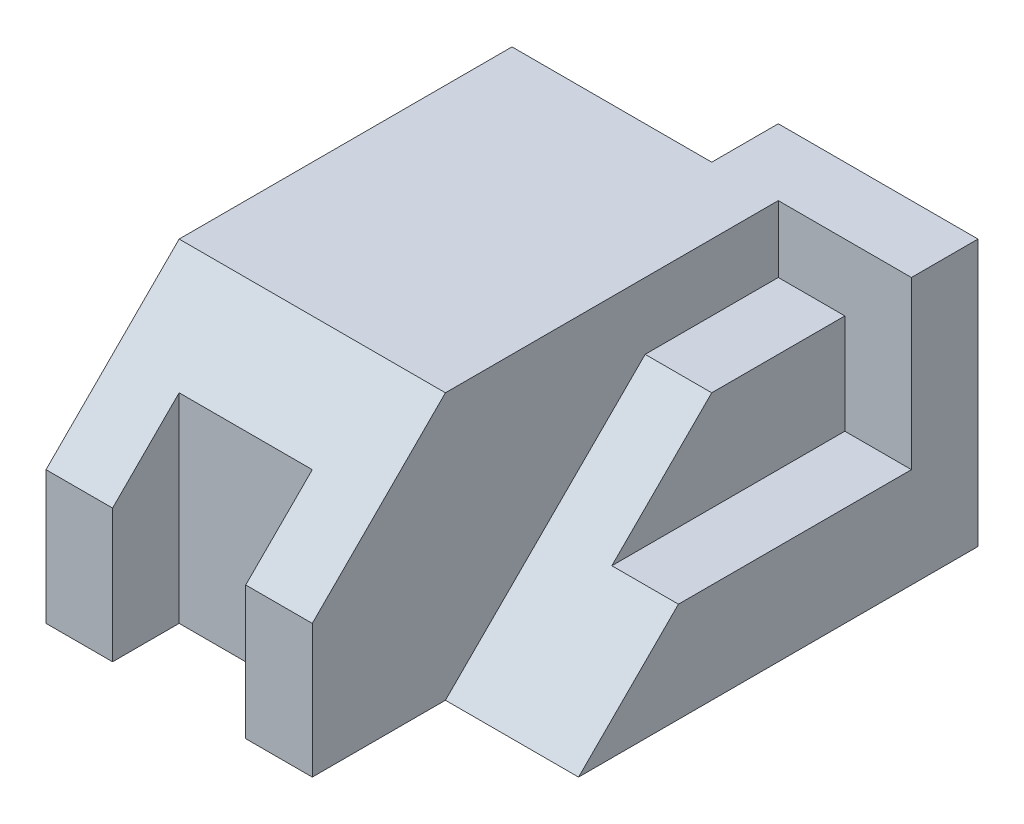
ISO-10303-21;
HEADER;
FILE_DESCRIPTION(('STEP AP214'),'2;1');
FILE_NAME('part.step','',(''),(''),'','','');
FILE_SCHEMA(('AUTOMOTIVE_DESIGN { 1 0 10303 214 1 1 1 1 }'));
ENDSEC;
DATA;
#1=APPLICATION_CONTEXT('core data for automotive mechanical design processes');
#2=APPLICATION_PROTOCOL_DEFINITION('international standard','automotive_design',2000,#1);
#3=PRODUCT_CONTEXT('',#1,'mechanical');
#4=PRODUCT('Part','Part','',(#3));
#5=PRODUCT_RELATED_PRODUCT_CATEGORY('part','',(#4));
#6=PRODUCT_DEFINITION_FORMATION('','',#4);
#7=PRODUCT_DEFINITION_CONTEXT('part definition',#1,'design');
#8=PRODUCT_DEFINITION('design','',#6,#7);
#9=PRODUCT_DEFINITION_SHAPE('','',#8);
#10=(LENGTH_UNIT() NAMED_UNIT(*) SI_UNIT(.MILLI.,.METRE.));
#11=(NAMED_UNIT(*) PLANE_ANGLE_UNIT() SI_UNIT($,.RADIAN.));
#12=(NAMED_UNIT(*) SI_UNIT($,.STERADIAN.) SOLID_ANGLE_UNIT());
#13=UNCERTAINTY_MEASURE_WITH_UNIT(LENGTH_MEASURE(1.E-05),#10,'distance_accuracy_value','');
#14=(GEOMETRIC_REPRESENTATION_CONTEXT(3) GLOBAL_UNCERTAINTY_ASSIGNED_CONTEXT((#13)) GLOBAL_UNIT_ASSIGNED_CONTEXT((#10,
#11,#12)) REPRESENTATION_CONTEXT('',''));
#15=CARTESIAN_POINT('',(0.,0.,0.));
#16=DIRECTION('',(0.,0.,1.));
#17=DIRECTION('',(1.,0.,0.));
#18=AXIS2_PLACEMENT_3D('',#15,#16,#17);
#19=CARTESIAN_POINT('',(0.,40.,49.9999999999999));
#20=DIRECTION('',(0.,-0.707106781186547,-0.707106781186547));
#21=DIRECTION('',(1.,0.,0.));
#22=AXIS2_PLACEMENT_3D('',#19,#20,#21);
#23=PLANE('',#22);
#24=DIRECTION('',(0.,0.707106781186548,-0.707106781186548));
#25=VECTOR('',#24,1.);
#26=CARTESIAN_POINT('',(40.,40.,49.9999999999999));
#27=LINE('',#26,#25);
#28=CARTESIAN_POINT('',(40.,40.,49.9999999999999));
#29=VERTEX_POINT('',#28);
#30=CARTESIAN_POINT('',(40.,19.9999999999999,70.));
#31=VERTEX_POINT('',#30);
#32=EDGE_CURVE('E47',#29,#31,#27,.F.);
#33=ORIENTED_EDGE('',*,*,#32,.F.);
#34=DIRECTION('',(1.,0.,0.));
#35=VECTOR('',#34,1.);
#36=CARTESIAN_POINT('',(0.,40.,49.9999999999999));
#37=LINE('',#36,#35);
#38=CARTESIAN_POINT('',(0.,40.,49.9999999999999));
#39=VERTEX_POINT('',#38);
#40=EDGE_CURVE('E251',#39,#29,#37,.T.);
#41=ORIENTED_EDGE('',*,*,#40,.F.);
#42=DIRECTION('',(0.,-0.707106781186548,0.707106781186548));
#43=VECTOR('',#42,1.);
#44=CARTESIAN_POINT('',(0.,40.,49.9999999999999));
#45=LINE('',#44,#43);
#46=CARTESIAN_POINT('',(0.,19.9999999999999,70.));
#47=VERTEX_POINT('',#46);
#48=EDGE_CURVE('E264',#47,#39,#45,.F.);
#49=ORIENTED_EDGE('',*,*,#48,.F.);
#50=DIRECTION('',(-1.,0.,0.));
#51=VECTOR('',#50,1.);
#52=CARTESIAN_POINT('',(10.,19.9999999999999,70.));
#53=LINE('',#52,#51);
#54=CARTESIAN_POINT('',(10.,19.9999999999999,70.));
#55=VERTEX_POINT('',#54);
#56=EDGE_CURVE('E55',#55,#47,#53,.T.);
#57=ORIENTED_EDGE('',*,*,#56,.F.);
#58=DIRECTION('',(0.,0.707106781186548,-0.707106781186548));
#59=VECTOR('',#58,1.);
#60=CARTESIAN_POINT('',(10.,40.,49.9999999999999));
#61=LINE('',#60,#59);
#62=CARTESIAN_POINT('',(10.,29.9999999999999,60.));
#63=VERTEX_POINT('',#62);
#64=EDGE_CURVE('E261',#63,#55,#61,.F.);
#65=ORIENTED_EDGE('',*,*,#64,.F.);
#66=DIRECTION('',(1.,0.,0.));
#67=VECTOR('',#66,1.);
#68=CARTESIAN_POINT('',(0.,29.9999999999999,60.));
#69=LINE('',#68,#67);
#70=CARTESIAN_POINT('',(30.,29.9999999999999,60.));
#71=VERTEX_POINT('',#70);
#72=EDGE_CURVE('E259',#71,#63,#69,.F.);
#73=ORIENTED_EDGE('',*,*,#72,.F.);
#74=DIRECTION('',(0.,-0.707106781186548,0.707106781186548));
#75=VECTOR('',#74,1.);
#76=CARTESIAN_POINT('',(30.,40.,49.9999999999999));
#77=LINE('',#76,#75);
#78=CARTESIAN_POINT('',(30.,19.9999999999999,70.));
#79=VERTEX_POINT('',#78);
#80=EDGE_CURVE('E257',#79,#71,#77,.F.);
#81=ORIENTED_EDGE('',*,*,#80,.F.);
#82=DIRECTION('',(1.,0.,0.));
#83=VECTOR('',#82,1.);
#84=CARTESIAN_POINT('',(0.,19.9999999999999,70.));
#85=LINE('',#84,#83);
#86=EDGE_CURVE('E255',#31,#79,#85,.F.);
#87=ORIENTED_EDGE('',*,*,#86,.F.);
#88=EDGE_LOOP('',(#33,#41,#49,#57,#65,#73,#81,#87));
#89=FACE_BOUND('',#88,.T.);
#90=ADVANCED_FACE('F33',(#89),#23,.F.);
#91=CARTESIAN_POINT('',(0.,40.,70.));
#92=DIRECTION('',(1.,0.,0.));
#93=DIRECTION('',(0.,0.,-1.));
#94=AXIS2_PLACEMENT_3D('',#91,#92,#93);
#95=PLANE('',#94);
#96=DIRECTION('',(0.,-1.,0.));
#97=VECTOR('',#96,1.);
#98=CARTESIAN_POINT('',(0.,40.,70.));
#99=LINE('',#98,#97);
#100=CARTESIAN_POINT('',(0.,0.,70.));
#101=VERTEX_POINT('',#100);
#102=EDGE_CURVE('E249',#47,#101,#99,.T.);
#103=ORIENTED_EDGE('',*,*,#102,.F.);
#104=ORIENTED_EDGE('',*,*,#48,.T.);
#105=DIRECTION('',(0.,0.,1.));
#106=VECTOR('',#105,1.);
#107=CARTESIAN_POINT('',(0.,40.,70.));
#108=LINE('',#107,#106);
#109=CARTESIAN_POINT('',(0.,40.,0.));
#110=VERTEX_POINT('',#109);
#111=EDGE_CURVE('E188',#110,#39,#108,.T.);
#112=ORIENTED_EDGE('',*,*,#111,.F.);
#113=DIRECTION('',(0.,-1.,0.));
#114=VECTOR('',#113,1.);
#115=CARTESIAN_POINT('',(0.,40.,0.));
#116=LINE('',#115,#114);
#117=CARTESIAN_POINT('',(0.,0.,0.));
#118=VERTEX_POINT('',#117);
#119=EDGE_CURVE('E200',#110,#118,#116,.T.);
#120=ORIENTED_EDGE('',*,*,#119,.T.);
#121=DIRECTION('',(0.,0.,1.));
#122=VECTOR('',#121,1.);
#123=CARTESIAN_POINT('',(0.,0.,70.));
#124=LINE('',#123,#122);
#125=EDGE_CURVE('E201',#118,#101,#124,.T.);
#126=ORIENTED_EDGE('',*,*,#125,.T.);
#127=EDGE_LOOP('',(#103,#104,#112,#120,#126));
#128=FACE_BOUND('',#127,.T.);
#129=ADVANCED_FACE('F318',(#128),#95,.F.);
#130=CARTESIAN_POINT('',(10.,40.,70.));
#131=DIRECTION('',(0.,0.,-1.));
#132=DIRECTION('',(-1.,0.,0.));
#133=AXIS2_PLACEMENT_3D('',#130,#131,#132);
#134=PLANE('',#133);
#135=DIRECTION('',(0.,-1.,0.));
#136=VECTOR('',#135,1.);
#137=CARTESIAN_POINT('',(10.,40.,70.));
#138=LINE('',#137,#136);
#139=CARTESIAN_POINT('',(10.,0.,70.));
#140=VERTEX_POINT('',#139);
#141=EDGE_CURVE('E247',#55,#140,#138,.T.);
#142=ORIENTED_EDGE('',*,*,#141,.F.);
#143=ORIENTED_EDGE('',*,*,#56,.T.);
#144=ORIENTED_EDGE('',*,*,#102,.T.);
#145=DIRECTION('',(1.,0.,0.));
#146=VECTOR('',#145,1.);
#147=CARTESIAN_POINT('',(10.,0.,70.));
#148=LINE('',#147,#146);
#149=EDGE_CURVE('E204',#101,#140,#148,.T.);
#150=ORIENTED_EDGE('',*,*,#149,.T.);
#151=EDGE_LOOP('',(#142,#143,#144,#150));
#152=FACE_BOUND('',#151,.T.);
#153=ADVANCED_FACE('F321',(#152),#134,.F.);
#154=CARTESIAN_POINT('',(10.,40.,60.));
#155=DIRECTION('',(-1.,0.,0.));
#156=DIRECTION('',(0.,0.,1.));
#157=AXIS2_PLACEMENT_3D('',#154,#155,#156);
#158=PLANE('',#157);
#159=DIRECTION('',(0.,-1.,0.));
#160=VECTOR('',#159,1.);
#161=CARTESIAN_POINT('',(10.,40.,60.));
#162=LINE('',#161,#160);
#163=CARTESIAN_POINT('',(10.,0.,60.));
#164=VERTEX_POINT('',#163);
#165=EDGE_CURVE('E245',#63,#164,#162,.T.);
#166=ORIENTED_EDGE('',*,*,#165,.F.);
#167=ORIENTED_EDGE('',*,*,#64,.T.);
#168=ORIENTED_EDGE('',*,*,#141,.T.);
#169=DIRECTION('',(0.,0.,-1.));
#170=VECTOR('',#169,1.);
#171=CARTESIAN_POINT('',(10.,0.,60.));
#172=LINE('',#171,#170);
#173=EDGE_CURVE('E207',#140,#164,#172,.T.);
#174=ORIENTED_EDGE('',*,*,#173,.T.);
#175=EDGE_LOOP('',(#166,#167,#168,#174));
#176=FACE_BOUND('',#175,.T.);
#177=ADVANCED_FACE('F327',(#176),#158,.F.);
#178=CARTESIAN_POINT('',(30.,40.,60.));
#179=DIRECTION('',(0.,0.,-1.));
#180=DIRECTION('',(-1.,0.,0.));
#181=AXIS2_PLACEMENT_3D('',#178,#179,#180);
#182=PLANE('',#181);
#183=DIRECTION('',(0.,-1.,0.));
#184=VECTOR('',#183,1.);
#185=CARTESIAN_POINT('',(30.,40.,60.));
#186=LINE('',#185,#184);
#187=CARTESIAN_POINT('',(30.,0.,60.));
#188=VERTEX_POINT('',#187);
#189=EDGE_CURVE('E243',#71,#188,#186,.T.);
#190=ORIENTED_EDGE('',*,*,#189,.F.);
#191=ORIENTED_EDGE('',*,*,#72,.T.);
#192=ORIENTED_EDGE('',*,*,#165,.T.);
#193=DIRECTION('',(1.,0.,0.));
#194=VECTOR('',#193,1.);
#195=CARTESIAN_POINT('',(30.,0.,60.));
#196=LINE('',#195,#194);
#197=EDGE_CURVE('E210',#164,#188,#196,.T.);
#198=ORIENTED_EDGE('',*,*,#197,.T.);
#199=EDGE_LOOP('',(#190,#191,#192,#198));
#200=FACE_BOUND('',#199,.T.);
#201=ADVANCED_FACE('F332',(#200),#182,.F.);
#202=CARTESIAN_POINT('',(30.,40.,70.));
#203=DIRECTION('',(1.,0.,0.));
#204=DIRECTION('',(0.,0.,-1.));
#205=AXIS2_PLACEMENT_3D('',#202,#203,#204);
#206=PLANE('',#205);
#207=DIRECTION('',(0.,-1.,0.));
#208=VECTOR('',#207,1.);
#209=CARTESIAN_POINT('',(30.,40.,70.));
#210=LINE('',#209,#208);
#211=CARTESIAN_POINT('',(30.,0.,70.));
#212=VERTEX_POINT('',#211);
#213=EDGE_CURVE('E241',#79,#212,#210,.T.);
#214=ORIENTED_EDGE('',*,*,#213,.F.);
#215=ORIENTED_EDGE('',*,*,#80,.T.);
#216=ORIENTED_EDGE('',*,*,#189,.T.);
#217=DIRECTION('',(0.,0.,1.));
#218=VECTOR('',#217,1.);
#219=CARTESIAN_POINT('',(30.,0.,70.));
#220=LINE('',#219,#218);
#221=EDGE_CURVE('E213',#188,#212,#220,.T.);
#222=ORIENTED_EDGE('',*,*,#221,.T.);
#223=EDGE_LOOP('',(#214,#215,#216,#222));
#224=FACE_BOUND('',#223,.T.);
#225=ADVANCED_FACE('F335',(#224),#206,.F.);
#226=CARTESIAN_POINT('',(40.,40.,70.));
#227=DIRECTION('',(0.,0.,-1.));
#228=DIRECTION('',(-1.,0.,0.));
#229=AXIS2_PLACEMENT_3D('',#226,#227,#228);
#230=PLANE('',#229);
#231=DIRECTION('',(0.,-1.,0.));
#232=VECTOR('',#231,1.);
#233=CARTESIAN_POINT('',(40.,40.,70.));
#234=LINE('',#233,#232);
#235=CARTESIAN_POINT('',(40.,0.,70.));
#236=VERTEX_POINT('',#235);
#237=EDGE_CURVE('E239',#31,#236,#234,.T.);
#238=ORIENTED_EDGE('',*,*,#237,.F.);
#239=ORIENTED_EDGE('',*,*,#86,.T.);
#240=ORIENTED_EDGE('',*,*,#213,.T.);
#241=DIRECTION('',(1.,0.,0.));
#242=VECTOR('',#241,1.);
#243=CARTESIAN_POINT('',(40.,0.,70.));
#244=LINE('',#243,#242);
#245=EDGE_CURVE('E216',#212,#236,#244,.T.);
#246=ORIENTED_EDGE('',*,*,#245,.T.);
#247=EDGE_LOOP('',(#238,#239,#240,#246));
#248=FACE_BOUND('',#247,.T.);
#249=ADVANCED_FACE('F339',(#248),#230,.F.);
#250=CARTESIAN_POINT('',(40.,40.,60.));
#251=DIRECTION('',(-1.,0.,0.));
#252=DIRECTION('',(0.,0.,1.));
#253=AXIS2_PLACEMENT_3D('',#250,#251,#252);
#254=PLANE('',#253);
#255=DIRECTION('',(0.,0.,-1.));
#256=VECTOR('',#255,1.);
#257=CARTESIAN_POINT('',(40.,0.,60.));
#258=LINE('',#257,#256);
#259=CARTESIAN_POINT('',(40.,0.,50.));
#260=VERTEX_POINT('',#259);
#261=EDGE_CURVE('E219',#236,#260,#258,.T.);
#262=ORIENTED_EDGE('',*,*,#261,.T.);
#263=DIRECTION('',(0.,0.707106781186548,-0.707106781186547));
#264=VECTOR('',#263,1.);
#265=CARTESIAN_POINT('',(40.,0.,50.));
#266=LINE('',#265,#264);
#267=CARTESIAN_POINT('',(40.,30.,20.));
#268=VERTEX_POINT('',#267);
#269=EDGE_CURVE('E178',#260,#268,#266,.T.);
#270=ORIENTED_EDGE('',*,*,#269,.T.);
#271=DIRECTION('',(0.,0.,-1.));
#272=VECTOR('',#271,1.);
#273=CARTESIAN_POINT('',(40.,30.,20.));
#274=LINE('',#273,#272);
#275=CARTESIAN_POINT('',(40.,30.,0.));
#276=VERTEX_POINT('',#275);
#277=EDGE_CURVE('E279',#268,#276,#274,.T.);
#278=ORIENTED_EDGE('',*,*,#277,.T.);
#279=DIRECTION('',(0.,1.,0.));
#280=VECTOR('',#279,1.);
#281=CARTESIAN_POINT('',(40.,30.,0.));
#282=LINE('',#281,#280);
#283=CARTESIAN_POINT('',(40.,40.,0.));
#284=VERTEX_POINT('',#283);
#285=EDGE_CURVE('E175',#276,#284,#282,.T.);
#286=ORIENTED_EDGE('',*,*,#285,.T.);
#287=DIRECTION('',(0.,0.,1.));
#288=VECTOR('',#287,1.);
#289=CARTESIAN_POINT('',(40.,40.,0.));
#290=LINE('',#289,#288);
#291=EDGE_CURVE('E184',#284,#29,#290,.T.);
#292=ORIENTED_EDGE('',*,*,#291,.T.);
#293=ORIENTED_EDGE('',*,*,#32,.T.);
#294=ORIENTED_EDGE('',*,*,#237,.T.);
#295=EDGE_LOOP('',(#262,#270,#278,#286,#292,#293,#294));
#296=FACE_BOUND('',#295,.T.);
#297=ADVANCED_FACE('F313',(#296),#254,.F.);
#298=CARTESIAN_POINT('',(60.,40.,-10.));
#299=DIRECTION('',(-1.,0.,0.));
#300=DIRECTION('',(0.,0.,1.));
#301=AXIS2_PLACEMENT_3D('',#298,#299,#300);
#302=PLANE('',#301);
#303=DIRECTION('',(0.,1.,0.));
#304=VECTOR('',#303,1.);
#305=CARTESIAN_POINT('',(60.,30.,0.));
#306=LINE('',#305,#304);
#307=CARTESIAN_POINT('',(60.,15.,0.));
#308=VERTEX_POINT('',#307);
#309=CARTESIAN_POINT('',(60.,40.,0.));
#310=VERTEX_POINT('',#309);
#311=EDGE_CURVE('E275',#308,#310,#306,.T.);
#312=ORIENTED_EDGE('',*,*,#311,.F.);
#313=DIRECTION('',(0.,0.,1.));
#314=VECTOR('',#313,1.);
#315=CARTESIAN_POINT('',(60.,15.,0.));
#316=LINE('',#315,#314);
#317=CARTESIAN_POINT('',(60.,15.,35.));
#318=VERTEX_POINT('',#317);
#319=EDGE_CURVE('E273',#308,#318,#316,.T.);
#320=ORIENTED_EDGE('',*,*,#319,.T.);
#321=DIRECTION('',(0.,0.707106781186548,-0.707106781186547));
#322=VECTOR('',#321,1.);
#323=CARTESIAN_POINT('',(60.,0.,50.));
#324=LINE('',#323,#322);
#325=CARTESIAN_POINT('',(60.,0.,50.));
#326=VERTEX_POINT('',#325);
#327=EDGE_CURVE('E281',#326,#318,#324,.T.);
#328=ORIENTED_EDGE('',*,*,#327,.F.);
#329=DIRECTION('',(0.,0.,-1.));
#330=VECTOR('',#329,1.);
#331=CARTESIAN_POINT('',(60.,0.,-10.));
#332=LINE('',#331,#330);
#333=CARTESIAN_POINT('',(60.,0.,-10.));
#334=VERTEX_POINT('',#333);
#335=EDGE_CURVE('E221',#326,#334,#332,.T.);
#336=ORIENTED_EDGE('',*,*,#335,.T.);
#337=DIRECTION('',(0.,-1.,0.));
#338=VECTOR('',#337,1.);
#339=CARTESIAN_POINT('',(60.,40.,-10.));
#340=LINE('',#339,#338);
#341=CARTESIAN_POINT('',(60.,40.,-10.));
#342=VERTEX_POINT('',#341);
#343=EDGE_CURVE('E236',#342,#334,#340,.T.);
#344=ORIENTED_EDGE('',*,*,#343,.F.);
#345=DIRECTION('',(0.,0.,-1.));
#346=VECTOR('',#345,1.);
#347=CARTESIAN_POINT('',(60.,40.,-10.));
#348=LINE('',#347,#346);
#349=EDGE_CURVE('E191',#310,#342,#348,.T.);
#350=ORIENTED_EDGE('',*,*,#349,.F.);
#351=EDGE_LOOP('',(#312,#320,#328,#336,#344,#350));
#352=FACE_BOUND('',#351,.T.);
#353=ADVANCED_FACE('F292',(#352),#302,.F.);
#354=CARTESIAN_POINT('',(30.,40.,-10.));
#355=DIRECTION('',(0.,0.,1.));
#356=DIRECTION('',(1.,0.,0.));
#357=AXIS2_PLACEMENT_3D('',#354,#355,#356);
#358=PLANE('',#357);
#359=DIRECTION('',(-1.,0.,0.));
#360=VECTOR('',#359,1.);
#361=CARTESIAN_POINT('',(30.,0.,-10.));
#362=LINE('',#361,#360);
#363=CARTESIAN_POINT('',(30.,0.,-10.));
#364=VERTEX_POINT('',#363);
#365=EDGE_CURVE('E223',#334,#364,#362,.T.);
#366=ORIENTED_EDGE('',*,*,#365,.T.);
#367=DIRECTION('',(0.,-1.,0.));
#368=VECTOR('',#367,1.);
#369=CARTESIAN_POINT('',(30.,40.,-10.));
#370=LINE('',#369,#368);
#371=CARTESIAN_POINT('',(30.,40.,-10.));
#372=VERTEX_POINT('',#371);
#373=EDGE_CURVE('E233',#372,#364,#370,.T.);
#374=ORIENTED_EDGE('',*,*,#373,.F.);
#375=DIRECTION('',(-1.,0.,0.));
#376=VECTOR('',#375,1.);
#377=CARTESIAN_POINT('',(30.,40.,-10.));
#378=LINE('',#377,#376);
#379=EDGE_CURVE('E194',#342,#372,#378,.T.);
#380=ORIENTED_EDGE('',*,*,#379,.F.);
#381=ORIENTED_EDGE('',*,*,#343,.T.);
#382=EDGE_LOOP('',(#366,#374,#380,#381));
#383=FACE_BOUND('',#382,.T.);
#384=ADVANCED_FACE('F300',(#383),#358,.F.);
#385=CARTESIAN_POINT('',(30.,40.,0.));
#386=DIRECTION('',(1.,0.,0.));
#387=DIRECTION('',(0.,0.,-1.));
#388=AXIS2_PLACEMENT_3D('',#385,#386,#387);
#389=PLANE('',#388);
#390=DIRECTION('',(0.,0.,1.));
#391=VECTOR('',#390,1.);
#392=CARTESIAN_POINT('',(30.,0.,0.));
#393=LINE('',#392,#391);
#394=CARTESIAN_POINT('',(30.,0.,0.));
#395=VERTEX_POINT('',#394);
#396=EDGE_CURVE('E225',#364,#395,#393,.T.);
#397=ORIENTED_EDGE('',*,*,#396,.T.);
#398=DIRECTION('',(0.,-1.,0.));
#399=VECTOR('',#398,1.);
#400=CARTESIAN_POINT('',(30.,40.,0.));
#401=LINE('',#400,#399);
#402=CARTESIAN_POINT('',(30.,40.,0.));
#403=VERTEX_POINT('',#402);
#404=EDGE_CURVE('E230',#403,#395,#401,.T.);
#405=ORIENTED_EDGE('',*,*,#404,.F.);
#406=DIRECTION('',(0.,0.,1.));
#407=VECTOR('',#406,1.);
#408=CARTESIAN_POINT('',(30.,40.,0.));
#409=LINE('',#408,#407);
#410=EDGE_CURVE('E196',#372,#403,#409,.T.);
#411=ORIENTED_EDGE('',*,*,#410,.F.);
#412=ORIENTED_EDGE('',*,*,#373,.T.);
#413=EDGE_LOOP('',(#397,#405,#411,#412));
#414=FACE_BOUND('',#413,.T.);
#415=ADVANCED_FACE('F304',(#414),#389,.F.);
#416=CARTESIAN_POINT('',(0.,40.,0.));
#417=DIRECTION('',(0.,0.,1.));
#418=DIRECTION('',(1.,0.,0.));
#419=AXIS2_PLACEMENT_3D('',#416,#417,#418);
#420=PLANE('',#419);
#421=DIRECTION('',(-1.,0.,0.));
#422=VECTOR('',#421,1.);
#423=CARTESIAN_POINT('',(0.,0.,0.));
#424=LINE('',#423,#422);
#425=EDGE_CURVE('E192',#395,#118,#424,.T.);
#426=ORIENTED_EDGE('',*,*,#425,.T.);
#427=ORIENTED_EDGE('',*,*,#119,.F.);
#428=DIRECTION('',(-1.,0.,0.));
#429=VECTOR('',#428,1.);
#430=CARTESIAN_POINT('',(0.,40.,0.));
#431=LINE('',#430,#429);
#432=EDGE_CURVE('E198',#403,#110,#431,.T.);
#433=ORIENTED_EDGE('',*,*,#432,.F.);
#434=ORIENTED_EDGE('',*,*,#404,.T.);
#435=EDGE_LOOP('',(#426,#427,#433,#434));
#436=FACE_BOUND('',#435,.T.);
#437=ADVANCED_FACE('F395',(#436),#420,.F.);
#438=CARTESIAN_POINT('',(0.,40.,0.));
#439=DIRECTION('',(0.,-1.,0.));
#440=DIRECTION('',(0.,0.,-1.));
#441=AXIS2_PLACEMENT_3D('',#438,#439,#440);
#442=PLANE('',#441);
#443=ORIENTED_EDGE('',*,*,#291,.F.);
#444=DIRECTION('',(1.,0.,0.));
#445=VECTOR('',#444,1.);
#446=CARTESIAN_POINT('',(40.,40.,0.));
#447=LINE('',#446,#445);
#448=EDGE_CURVE('E177',#284,#310,#447,.T.);
#449=ORIENTED_EDGE('',*,*,#448,.T.);
#450=ORIENTED_EDGE('',*,*,#349,.T.);
#451=ORIENTED_EDGE('',*,*,#379,.T.);
#452=ORIENTED_EDGE('',*,*,#410,.T.);
#453=ORIENTED_EDGE('',*,*,#432,.T.);
#454=ORIENTED_EDGE('',*,*,#111,.T.);
#455=ORIENTED_EDGE('',*,*,#40,.T.);
#456=EDGE_LOOP('',(#443,#449,#450,#451,#452,#453,#454,#455));
#457=FACE_BOUND('',#456,.T.);
#458=ADVANCED_FACE('F309',(#457),#442,.F.);
#459=CARTESIAN_POINT('',(0.,0.,0.));
#460=DIRECTION('',(0.,-1.,0.));
#461=DIRECTION('',(0.,0.,-1.));
#462=AXIS2_PLACEMENT_3D('',#459,#460,#461);
#463=PLANE('',#462);
#464=DIRECTION('',(1.,0.,0.));
#465=VECTOR('',#464,1.);
#466=CARTESIAN_POINT('',(40.,0.,50.));
#467=LINE('',#466,#465);
#468=EDGE_CURVE('E181',#260,#326,#467,.T.);
#469=ORIENTED_EDGE('',*,*,#468,.F.);
#470=ORIENTED_EDGE('',*,*,#261,.F.);
#471=ORIENTED_EDGE('',*,*,#245,.F.);
#472=ORIENTED_EDGE('',*,*,#221,.F.);
#473=ORIENTED_EDGE('',*,*,#197,.F.);
#474=ORIENTED_EDGE('',*,*,#173,.F.);
#475=ORIENTED_EDGE('',*,*,#149,.F.);
#476=ORIENTED_EDGE('',*,*,#125,.F.);
#477=ORIENTED_EDGE('',*,*,#425,.F.);
#478=ORIENTED_EDGE('',*,*,#396,.F.);
#479=ORIENTED_EDGE('',*,*,#365,.F.);
#480=ORIENTED_EDGE('',*,*,#335,.F.);
#481=EDGE_LOOP('',(#469,#470,#471,#472,#473,#474,#475,#476,#477,#478,#479,#480));
#482=FACE_BOUND('',#481,.T.);
#483=ADVANCED_FACE('F295',(#482),#463,.T.);
#484=CARTESIAN_POINT('',(40.,30.,20.));
#485=DIRECTION('',(0.,-1.,0.));
#486=DIRECTION('',(0.,0.,-1.));
#487=AXIS2_PLACEMENT_3D('',#484,#485,#486);
#488=PLANE('',#487);
#489=DIRECTION('',(1.,0.,0.));
#490=VECTOR('',#489,1.);
#491=CARTESIAN_POINT('',(40.,30.,20.));
#492=LINE('',#491,#490);
#493=CARTESIAN_POINT('',(50.,30.,20.));
#494=VERTEX_POINT('',#493);
#495=EDGE_CURVE('E171',#268,#494,#492,.T.);
#496=ORIENTED_EDGE('',*,*,#495,.T.);
#497=DIRECTION('',(0.,0.,1.));
#498=VECTOR('',#497,1.);
#499=CARTESIAN_POINT('',(50.,30.,0.));
#500=LINE('',#499,#498);
#501=CARTESIAN_POINT('',(50.,30.,0.));
#502=VERTEX_POINT('',#501);
#503=EDGE_CURVE('E155',#502,#494,#500,.T.);
#504=ORIENTED_EDGE('',*,*,#503,.F.);
#505=DIRECTION('',(1.,0.,0.));
#506=VECTOR('',#505,1.);
#507=CARTESIAN_POINT('',(40.,30.,0.));
#508=LINE('',#507,#506);
#509=EDGE_CURVE('E169',#276,#502,#508,.T.);
#510=ORIENTED_EDGE('',*,*,#509,.F.);
#511=ORIENTED_EDGE('',*,*,#277,.F.);
#512=EDGE_LOOP('',(#496,#504,#510,#511));
#513=FACE_BOUND('',#512,.T.);
#514=ADVANCED_FACE('F167',(#513),#488,.F.);
#515=CARTESIAN_POINT('',(40.,0.,50.));
#516=DIRECTION('',(0.,-0.707106781186547,-0.707106781186548));
#517=DIRECTION('',(0.,0.707106781186548,-0.707106781186547));
#518=AXIS2_PLACEMENT_3D('',#515,#516,#517);
#519=PLANE('',#518);
#520=ORIENTED_EDGE('',*,*,#327,.T.);
#521=DIRECTION('',(-1.,0.,0.));
#522=VECTOR('',#521,1.);
#523=CARTESIAN_POINT('',(40.,15.,35.));
#524=LINE('',#523,#522);
#525=CARTESIAN_POINT('',(50.,15.,35.));
#526=VERTEX_POINT('',#525);
#527=EDGE_CURVE('E11',#318,#526,#524,.T.);
#528=ORIENTED_EDGE('',*,*,#527,.T.);
#529=DIRECTION('',(0.,0.707106781186548,-0.707106781186547));
#530=VECTOR('',#529,1.);
#531=CARTESIAN_POINT('',(50.,0.,50.));
#532=LINE('',#531,#530);
#533=EDGE_CURVE('E40',#526,#494,#532,.T.);
#534=ORIENTED_EDGE('',*,*,#533,.T.);
#535=ORIENTED_EDGE('',*,*,#495,.F.);
#536=ORIENTED_EDGE('',*,*,#269,.F.);
#537=ORIENTED_EDGE('',*,*,#468,.T.);
#538=EDGE_LOOP('',(#520,#528,#534,#535,#536,#537));
#539=FACE_BOUND('',#538,.T.);
#540=ADVANCED_FACE('F267',(#539),#519,.F.);
#541=CARTESIAN_POINT('',(40.,30.,0.));
#542=DIRECTION('',(0.,0.,-1.));
#543=DIRECTION('',(0.,1.,0.));
#544=AXIS2_PLACEMENT_3D('',#541,#542,#543);
#545=PLANE('',#544);
#546=ORIENTED_EDGE('',*,*,#311,.T.);
#547=ORIENTED_EDGE('',*,*,#448,.F.);
#548=ORIENTED_EDGE('',*,*,#285,.F.);
#549=ORIENTED_EDGE('',*,*,#509,.T.);
#550=DIRECTION('',(0.,-1.,0.));
#551=VECTOR('',#550,1.);
#552=CARTESIAN_POINT('',(50.,15.,0.));
#553=LINE('',#552,#551);
#554=CARTESIAN_POINT('',(50.,15.,0.));
#555=VERTEX_POINT('',#554);
#556=EDGE_CURVE('E152',#502,#555,#553,.T.);
#557=ORIENTED_EDGE('',*,*,#556,.T.);
#558=DIRECTION('',(1.,0.,0.));
#559=VECTOR('',#558,1.);
#560=CARTESIAN_POINT('',(60.,15.,0.));
#561=LINE('',#560,#559);
#562=EDGE_CURVE('E163',#555,#308,#561,.T.);
#563=ORIENTED_EDGE('',*,*,#562,.T.);
#564=EDGE_LOOP('',(#546,#547,#548,#549,#557,#563));
#565=FACE_BOUND('',#564,.T.);
#566=ADVANCED_FACE('F173',(#565),#545,.F.);
#567=CARTESIAN_POINT('',(60.,15.,0.));
#568=DIRECTION('',(0.,-1.,0.));
#569=DIRECTION('',(1.,0.,0.));
#570=AXIS2_PLACEMENT_3D('',#567,#568,#569);
#571=PLANE('',#570);
#572=ORIENTED_EDGE('',*,*,#319,.F.);
#573=ORIENTED_EDGE('',*,*,#562,.F.);
#574=DIRECTION('',(0.,0.,1.));
#575=VECTOR('',#574,1.);
#576=CARTESIAN_POINT('',(50.,15.,0.));
#577=LINE('',#576,#575);
#578=EDGE_CURVE('E158',#555,#526,#577,.T.);
#579=ORIENTED_EDGE('',*,*,#578,.T.);
#580=ORIENTED_EDGE('',*,*,#527,.F.);
#581=EDGE_LOOP('',(#572,#573,#579,#580));
#582=FACE_BOUND('',#581,.T.);
#583=ADVANCED_FACE('F271',(#582),#571,.F.);
#584=CARTESIAN_POINT('',(50.,15.,0.));
#585=DIRECTION('',(-1.,0.,0.));
#586=DIRECTION('',(0.,0.,1.));
#587=AXIS2_PLACEMENT_3D('',#584,#585,#586);
#588=PLANE('',#587);
#589=ORIENTED_EDGE('',*,*,#578,.F.);
#590=ORIENTED_EDGE('',*,*,#556,.F.);
#591=ORIENTED_EDGE('',*,*,#503,.T.);
#592=ORIENTED_EDGE('',*,*,#533,.F.);
#593=EDGE_LOOP('',(#589,#590,#591,#592));
#594=FACE_BOUND('',#593,.T.);
#595=ADVANCED_FACE('F154',(#594),#588,.F.);
#596=CLOSED_SHELL('',(#90,#129,#153,#177,#201,#225,#249,#297,#353,#384,#415,#437,#458,#483,#514,
#540,#566,#583,#595));
#597=MANIFOLD_SOLID_BREP('B2',#596);
#598=ADVANCED_BREP_SHAPE_REPRESENTATION('',(#18,#597),#14);
#599=SHAPE_DEFINITION_REPRESENTATION(#9,#598);
ENDSEC;
END-ISO-10303-21;
